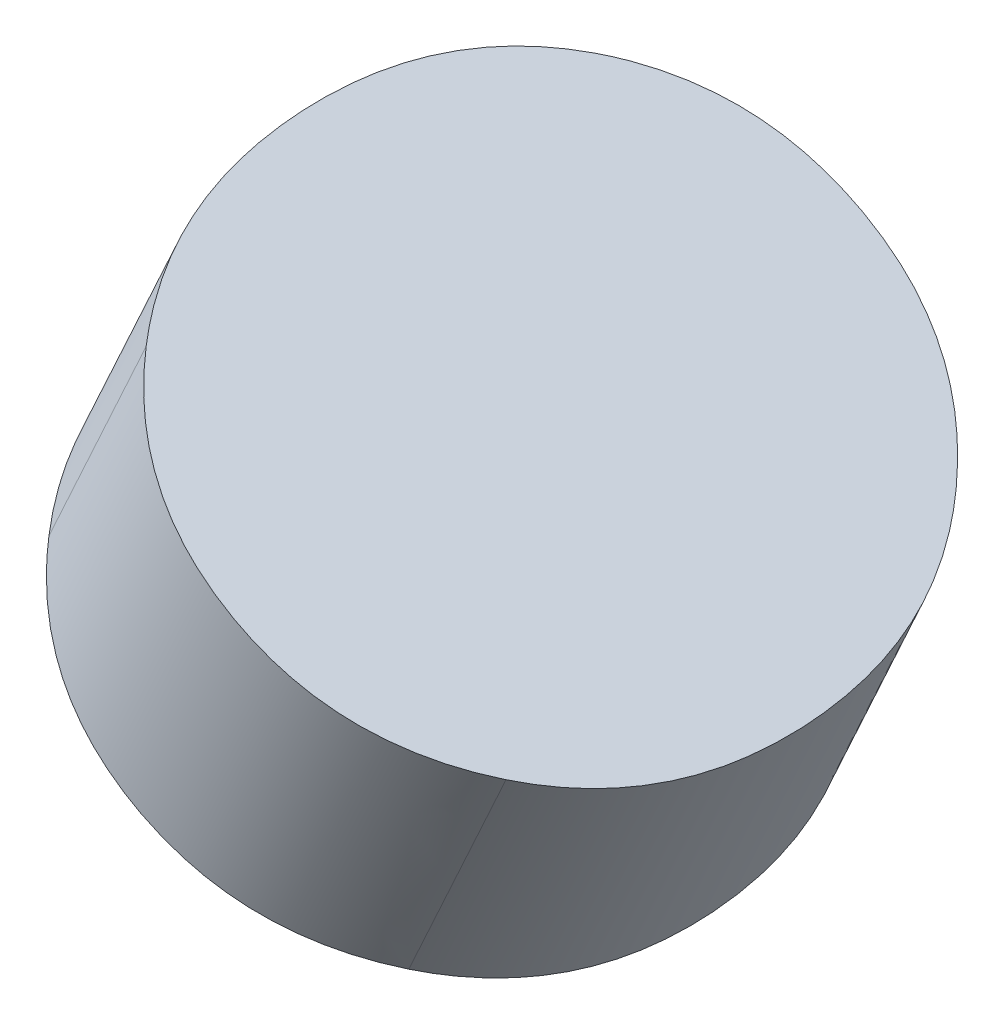
ISO-10303-21;
HEADER;
FILE_DESCRIPTION(('STEP AP214'),'2;1');
FILE_NAME('part.step','',(''),(''),'','','');
FILE_SCHEMA(('AUTOMOTIVE_DESIGN { 1 0 10303 214 1 1 1 1 }'));
ENDSEC;
DATA;
#1=APPLICATION_CONTEXT('core data for automotive mechanical design processes');
#2=APPLICATION_PROTOCOL_DEFINITION('international standard','automotive_design',2000,#1);
#3=PRODUCT_CONTEXT('',#1,'mechanical');
#4=PRODUCT('Part','Part','',(#3));
#5=PRODUCT_RELATED_PRODUCT_CATEGORY('part','',(#4));
#6=PRODUCT_DEFINITION_FORMATION('','',#4);
#7=PRODUCT_DEFINITION_CONTEXT('part definition',#1,'design');
#8=PRODUCT_DEFINITION('design','',#6,#7);
#9=PRODUCT_DEFINITION_SHAPE('','',#8);
#10=(LENGTH_UNIT() NAMED_UNIT(*) SI_UNIT(.MILLI.,.METRE.));
#11=(NAMED_UNIT(*) PLANE_ANGLE_UNIT() SI_UNIT($,.RADIAN.));
#12=(NAMED_UNIT(*) SI_UNIT($,.STERADIAN.) SOLID_ANGLE_UNIT());
#13=UNCERTAINTY_MEASURE_WITH_UNIT(LENGTH_MEASURE(1.E-05),#10,'distance_accuracy_value','');
#14=(GEOMETRIC_REPRESENTATION_CONTEXT(3) GLOBAL_UNCERTAINTY_ASSIGNED_CONTEXT((#13)) GLOBAL_UNIT_ASSIGNED_CONTEXT((#10,
#11,#12)) REPRESENTATION_CONTEXT('',''));
#15=CARTESIAN_POINT('',(0.,0.,0.));
#16=DIRECTION('',(0.,0.,1.));
#17=DIRECTION('',(1.,0.,0.));
#18=AXIS2_PLACEMENT_3D('',#15,#16,#17);
#19=CARTESIAN_POINT('',(5.98629531264846,7.6518678061337,-2.70885291158316));
#20=CARTESIAN_POINT('',(5.98762475457034,7.65139448567997,-2.71031634987988));
#21=CARTESIAN_POINT('',(6.02193615023742,7.63908467378837,-2.74756750561273));
#22=CARTESIAN_POINT('',(6.07789316338917,7.61545117907034,-2.78868061699597));
#23=CARTESIAN_POINT('',(6.15934109940241,7.57511022199703,-2.81572901143361));
#24=CARTESIAN_POINT('',(6.22653275771296,7.53907823213657,-2.8228524474128));
#25=CARTESIAN_POINT('',(6.29300847489024,7.50104766592302,-2.81674962377831));
#26=CARTESIAN_POINT('',(6.37159685840994,7.45271556858546,-2.7909233637115));
#27=CARTESIAN_POINT('',(6.42313357703592,7.41679148584207,-2.75064569518387));
#28=CARTESIAN_POINT('',(6.45343294077434,7.3933062035269,-2.71391271836709));
#29=CARTESIAN_POINT('',(6.45458939810901,7.39240581747993,-2.71248859013043));
#30=(BOUNDED_CURVE() B_SPLINE_CURVE(3,(#19,#20,#21,#22,#23,#24,#25,#26,#27,#28,#29),
.UNSPECIFIED.,.F.,.F.) B_SPLINE_CURVE_WITH_KNOTS((4,1,1,1,1,1,1,1,4),(0.,0.009919115084285,
0.2549865314289,0.3775202396012,0.5000539477735,0.6225945654816,0.7451351831897,0.990216418606,
1.),.UNSPECIFIED.) CURVE() GEOMETRIC_REPRESENTATION_ITEM() RATIONAL_B_SPLINE_CURVE((1.,1.,1.,1.,
1.,1.,1.,1.,1.,1.,1.)) REPRESENTATION_ITEM(''));
#31=DIRECTION('',(-0.479603965309405,-0.863428854211439,-0.15643097575166));
#32=VECTOR('',#31,1.);
#33=SURFACE_OF_LINEAR_EXTRUSION('',#30,#32);
#34=DIRECTION('',(-0.479603965309405,-0.863428854211439,-0.15643097575166));
#35=VECTOR('',#34,1.);
#36=CARTESIAN_POINT('',(5.92795097427504,7.53818549018173,-2.73353620808216));
#37=LINE('',#36,#35);
#38=CARTESIAN_POINT('',(5.92795097427504,7.53818549018173,-2.73353620808216));
#39=VERTEX_POINT('',#38);
#40=CARTESIAN_POINT('',(5.74251238885074,7.2043412417586,-2.79402015100196));
#41=VERTEX_POINT('',#40);
#42=EDGE_CURVE('E11',#39,#41,#37,.T.);
#43=ORIENTED_EDGE('',*,*,#42,.F.);
#44=CARTESIAN_POINT('',(6.38875156484517,7.28286466866965,-2.7370548595334));
#45=CARTESIAN_POINT('',(6.35944906149116,7.30547700433996,-2.77202585073956));
#46=CARTESIAN_POINT('',(6.30924834291947,7.34046981753757,-2.81125939056251));
#47=CARTESIAN_POINT('',(6.23065995939977,7.38880191487513,-2.83708565062932));
#48=CARTESIAN_POINT('',(6.16418424222298,7.42683248108956,-2.84318847426383));
#49=CARTESIAN_POINT('',(6.09699258391243,7.46286447095002,-2.83606503828463));
#50=CARTESIAN_POINT('',(6.01554464789884,7.50320542802257,-2.80901664383698));
#51=CARTESIAN_POINT('',(5.96105787129404,7.52621796701637,-2.76898375450914));
#52=CARTESIAN_POINT('',(5.92795097427504,7.53818549018173,-2.73353620808216));
#53=B_SPLINE_CURVE_WITH_KNOTS('',3,(#44,#45,#46,#47,#48,#49,#50,#51,#52),.UNSPECIFIED.,.F.,.F.,
(4,1,1,1,1,1,4),(0.,0.2500070484085,0.3750105726127,0.500014096817,0.6250105726127,
0.7500070484085,1.),.UNSPECIFIED.);
#54=CARTESIAN_POINT('',(6.38875156484517,7.28286466866965,-2.7370548595334));
#55=VERTEX_POINT('',#54);
#56=EDGE_CURVE('E47',#55,#39,#53,.T.);
#57=ORIENTED_EDGE('',*,*,#56,.F.);
#58=DIRECTION('',(-0.479603965309405,-0.863428854211439,-0.15643097575166));
#59=VECTOR('',#58,1.);
#60=CARTESIAN_POINT('',(6.38875156484517,7.28286466866965,-2.7370548595334));
#61=LINE('',#60,#59);
#62=CARTESIAN_POINT('',(6.20331297942086,6.94902042024652,-2.7975388024532));
#63=VERTEX_POINT('',#62);
#64=EDGE_CURVE('E86',#55,#63,#61,.T.);
#65=ORIENTED_EDGE('',*,*,#64,.T.);
#66=CARTESIAN_POINT('',(5.74251238885074,7.2043412417586,-2.79402015100196));
#67=CARTESIAN_POINT('',(5.77561928586939,7.19237371859248,-2.82946769741893));
#68=CARTESIAN_POINT('',(5.83010606247405,7.16936117959856,-2.86950058675677));
#69=CARTESIAN_POINT('',(5.91155399848778,7.12902022252613,-2.89654898119442));
#70=CARTESIAN_POINT('',(5.97874565679819,7.09298823266555,-2.90367241718362));
#71=CARTESIAN_POINT('',(6.04522137397561,7.05495766645212,-2.89756959353912));
#72=CARTESIAN_POINT('',(6.1238097574953,7.00662556911456,-2.87174333347231));
#73=CARTESIAN_POINT('',(6.17401047606651,6.97163275591608,-2.83250979364935));
#74=CARTESIAN_POINT('',(6.20331297942086,6.94902042024652,-2.7975388024532));
#75=B_SPLINE_CURVE_WITH_KNOTS('',3,(#66,#67,#68,#69,#70,#71,#72,#73,#74),.UNSPECIFIED.,.F.,.F.,
(4,1,1,1,1,1,4),(0.,0.2499929515915,0.3749894273873,0.499985903183,0.6249894273873,
0.7499929515915,1.),.UNSPECIFIED.);
#76=EDGE_CURVE('E81',#41,#63,#75,.T.);
#77=ORIENTED_EDGE('',*,*,#76,.F.);
#78=EDGE_LOOP('',(#43,#57,#65,#77));
#79=FACE_BOUND('',#78,.T.);
#80=ADVANCED_FACE('F17',(#79),#33,.T.);
#81=CARTESIAN_POINT('',(5.95552121621187,7.5714000306122,-2.17035612413858));
#82=CARTESIAN_POINT('',(5.95436901926692,7.57229670979813,-2.17177285415556));
#83=CARTESIAN_POINT('',(5.92486076714491,7.59537143757636,-2.20866523439478));
#84=CARTESIAN_POINT('',(5.89395022798105,7.62381940171874,-2.27091617851873));
#85=CARTESIAN_POINT('',(5.87767646136616,7.64988819658238,-2.36491026511709));
#86=CARTESIAN_POINT('',(5.87756406124387,7.66431503831933,-2.44419535444724));
#87=CARTESIAN_POINT('',(5.88892142609277,7.67236671897118,-2.52345772916173));
#88=CARTESIAN_POINT('',(5.91851918123459,7.67293622006967,-2.61734530059675));
#89=CARTESIAN_POINT('',(5.95825880666693,7.66210434491754,-2.679396491797));
#90=CARTESIAN_POINT('',(5.99300723727406,7.64944883693318,-2.71607947176047));
#91=CARTESIAN_POINT('',(5.99437927094351,7.6489453654188,-2.71750707236914));
#92=(BOUNDED_CURVE() B_SPLINE_CURVE(3,(#81,#82,#83,#84,#85,#86,#87,#88,#89,#90,#91),
.UNSPECIFIED.,.F.,.F.) B_SPLINE_CURVE_WITH_KNOTS((4,1,1,1,1,1,1,1,4),(0.,0.009838611854684,
0.2548174635686,0.3773068894255,0.4997963152825,0.6223513768837,0.7449064384849,0.9900165616873,
1.),.UNSPECIFIED.) CURVE() GEOMETRIC_REPRESENTATION_ITEM() RATIONAL_B_SPLINE_CURVE((1.,1.,1.,1.,
1.,1.,1.,1.,1.,1.,1.)) REPRESENTATION_ITEM(''));
#93=DIRECTION('',(-0.479603965309405,-0.863428854211439,-0.15643097575166));
#94=VECTOR('',#93,1.);
#95=SURFACE_OF_LINEAR_EXTRUSION('',#92,#94);
#96=DIRECTION('',(-0.479603965309405,-0.863428854211439,-0.15643097575166));
#97=VECTOR('',#96,1.);
#98=CARTESIAN_POINT('',(5.88975472027792,7.46182705151872,-2.19496541877811));
#99=LINE('',#98,#97);
#100=CARTESIAN_POINT('',(5.88975472027792,7.46182705151872,-2.19496541877811));
#101=VERTEX_POINT('',#100);
#102=CARTESIAN_POINT('',(5.70431613485313,7.12798280309471,-2.2554493616979));
#103=VERTEX_POINT('',#102);
#104=EDGE_CURVE('E94',#101,#103,#99,.T.);
#105=ORIENTED_EDGE('',*,*,#104,.F.);
#106=CARTESIAN_POINT('',(5.92795097427504,7.53818549018173,-2.73353620808216));
#107=CARTESIAN_POINT('',(5.89485974292957,7.55014494300702,-2.69809214661943));
#108=CARTESIAN_POINT('',(5.85617066574461,7.56069046902266,-2.63768132744778));
#109=CARTESIAN_POINT('',(5.8265729106023,7.56012096792329,-2.54379375601275));
#110=CARTESIAN_POINT('',(5.8152155457534,7.55206928727144,-2.46453138129825));
#111=CARTESIAN_POINT('',(5.81532794587569,7.53764244553449,-2.3852462919681));
#112=CARTESIAN_POINT('',(5.83160171249058,7.51157365067085,-2.29125220536974));
#113=CARTESIAN_POINT('',(5.86170623192498,7.48386749243044,-2.23062450984276));
#114=CARTESIAN_POINT('',(5.88975472027792,7.46182705151872,-2.19496541877811));
#115=B_SPLINE_CURVE_WITH_KNOTS('',3,(#106,#107,#108,#109,#110,#111,#112,#113,#114),
.UNSPECIFIED.,.F.,.F.,(4,1,1,1,1,1,4),(0.,0.25006696309,0.375100444635,0.50013392618,
0.625100444635,0.75006696309,1.),.UNSPECIFIED.);
#116=EDGE_CURVE('E29',#39,#101,#115,.T.);
#117=ORIENTED_EDGE('',*,*,#116,.F.);
#118=ORIENTED_EDGE('',*,*,#42,.T.);
#119=CARTESIAN_POINT('',(5.70431613485313,7.12798280309471,-2.2554493616979));
#120=CARTESIAN_POINT('',(5.67626764650082,7.15002324400743,-2.29110845275256));
#121=CARTESIAN_POINT('',(5.64616312706579,7.17772940224684,-2.35173614828952));
#122=CARTESIAN_POINT('',(5.62988936045152,7.20379819711148,-2.4457302348779));
#123=CARTESIAN_POINT('',(5.62977696032923,7.21822503884843,-2.52501532420805));
#124=CARTESIAN_POINT('',(5.64113432517814,7.22627671950028,-2.60427769892255));
#125=CARTESIAN_POINT('',(5.67073208031982,7.22684622059865,-2.69816527036756));
#126=CARTESIAN_POINT('',(5.7094211575054,7.216300694584,-2.75857608952923));
#127=CARTESIAN_POINT('',(5.74251238885074,7.2043412417586,-2.79402015100196));
#128=B_SPLINE_CURVE_WITH_KNOTS('',3,(#119,#120,#121,#122,#123,#124,#125,#126,#127),
.UNSPECIFIED.,.F.,.F.,(4,1,1,1,1,1,4),(0.,0.24993303691,0.374899555365,0.49986607382,
0.624899555365,0.74993303691,1.),.UNSPECIFIED.);
#129=EDGE_CURVE('E96',#103,#41,#128,.T.);
#130=ORIENTED_EDGE('',*,*,#129,.F.);
#131=EDGE_LOOP('',(#105,#117,#118,#130));
#132=FACE_BOUND('',#131,.T.);
#133=ADVANCED_FACE('F159',(#132),#95,.T.);
#134=CARTESIAN_POINT('',(6.11072957166849,7.31988000552062,-2.08897131981858));
#135=DIRECTION('',(0.479603965309405,0.863428854211439,0.15643097575166));
#136=DIRECTION('',(0.310089363611885,0.,-0.950707413758185));
#137=AXIS2_PLACEMENT_3D('',#134,#135,#136);
#138=PLANE('',#137);
#139=CARTESIAN_POINT('',(6.34877093628127,7.20749491793282,-2.19847044482981));
#140=CARTESIAN_POINT('',(6.38370778476195,7.19463638459697,-2.23461048893876));
#141=CARTESIAN_POINT('',(6.42447100425988,7.18307607987447,-2.29577932715858));
#142=CARTESIAN_POINT('',(6.45546175094043,7.18295650907645,-2.39013432333844));
#143=CARTESIAN_POINT('',(6.46714107976885,7.19084977862544,-2.46950945375151));
#144=CARTESIAN_POINT('',(6.46677092092275,7.20539945655721,-2.54868227765138));
#145=CARTESIAN_POINT('',(6.4495704287285,7.23189897424035,-2.64221249988965));
#146=CARTESIAN_POINT('',(6.41805430700368,7.26025281039325,-2.70208723549265));
#147=CARTESIAN_POINT('',(6.38875156484517,7.28286466866965,-2.7370548595334));
#148=B_SPLINE_CURVE_WITH_KNOTS('',3,(#139,#140,#141,#142,#143,#144,#145,#146,#147),
.UNSPECIFIED.,.F.,.F.,(4,1,1,1,1,1,4),(0.,0.24993303691,0.374899555365,0.49986607382,
0.624899555365,0.74993303691,1.),.UNSPECIFIED.);
#149=CARTESIAN_POINT('',(6.34877093628127,7.20749491793282,-2.19847044482981));
#150=VERTEX_POINT('',#149);
#151=EDGE_CURVE('E98',#150,#55,#148,.T.);
#152=ORIENTED_EDGE('',*,*,#151,.T.);
#153=ORIENTED_EDGE('',*,*,#56,.T.);
#154=ORIENTED_EDGE('',*,*,#116,.T.);
#155=CARTESIAN_POINT('',(5.88975472027792,7.46182705151872,-2.19496541877811));
#156=CARTESIAN_POINT('',(5.91781635369587,7.43977350129836,-2.15927427187358));
#157=CARTESIAN_POINT('',(5.96661821036554,7.40541567438791,-2.11925678097025));
#158=CARTESIAN_POINT('',(6.04430343935176,7.35750070939456,-2.0929639100318));
#159=CARTESIAN_POINT('',(6.10989888454189,7.31993392860747,-2.08672213554805));
#160=CARTESIAN_POINT('',(6.17635789197974,7.28432613693814,-2.09394071057421));
#161=CARTESIAN_POINT('',(6.25772078141178,7.24412472081588,-2.1214985629804));
#162=CARTESIAN_POINT('',(6.31382152141695,7.22035458818351,-2.16229814854955));
#163=CARTESIAN_POINT('',(6.34877093628127,7.20749491793282,-2.19847044482981));
#164=B_SPLINE_CURVE_WITH_KNOTS('',3,(#155,#156,#157,#158,#159,#160,#161,#162,#163),
.UNSPECIFIED.,.F.,.F.,(4,1,1,1,1,1,4),(0.,0.2533428571429,0.3800142857143,0.5066857142857,
0.6300142857143,0.7533428571429,1.),.UNSPECIFIED.);
#165=EDGE_CURVE('E21',#101,#150,#164,.T.);
#166=ORIENTED_EDGE('',*,*,#165,.T.);
#167=EDGE_LOOP('',(#152,#153,#154,#166));
#168=FACE_BOUND('',#167,.T.);
#169=ADVANCED_FACE('F165',(#168),#138,.T.);
#170=CARTESIAN_POINT('',(6.44756880378263,7.39782264161647,-2.72086249034456));
#171=CARTESIAN_POINT('',(6.44875898113704,7.396912717011,-2.71948909622314));
#172=CARTESIAN_POINT('',(6.47956820211204,7.37324943712933,-2.68333683123879));
#173=CARTESIAN_POINT('',(6.51191894421849,7.34414472528736,-2.62187647303862));
#174=CARTESIAN_POINT('',(6.52911943641322,7.3176452076051,-2.52834625080036));
#175=CARTESIAN_POINT('',(6.52948959525932,7.30309552967332,-2.4491734269005));
#176=CARTESIAN_POINT('',(6.5178102664309,7.29520226012434,-2.36979829648743));
#177=CARTESIAN_POINT('',(6.48681951975035,7.29532183092236,-2.27544330030757));
#178=CARTESIAN_POINT('',(6.44499177567488,7.30718403104569,-2.21267704823027));
#179=CARTESIAN_POINT('',(6.40837043257036,7.3207559692908,-2.1753101632455));
#180=CARTESIAN_POINT('',(6.40697806017258,7.32127548023884,-2.17390873631907));
#181=(BOUNDED_CURVE() B_SPLINE_CURVE(3,(#170,#171,#172,#173,#174,#175,#176,#177,#178,#179,#180),
.UNSPECIFIED.,.F.,.F.) B_SPLINE_CURVE_WITH_KNOTS((4,1,1,1,1,1,1,1,4),(0.,0.009741395301832,
0.2549714475244,0.3775864736357,0.500201499747,0.6227508579994,0.7453002162518,0.9903989327566,
1.),.UNSPECIFIED.) CURVE() GEOMETRIC_REPRESENTATION_ITEM() RATIONAL_B_SPLINE_CURVE((1.,1.,1.,1.,
1.,1.,1.,1.,1.,1.,1.)) REPRESENTATION_ITEM(''));
#182=DIRECTION('',(-0.479603965309405,-0.863428854211439,-0.15643097575166));
#183=VECTOR('',#182,1.);
#184=SURFACE_OF_LINEAR_EXTRUSION('',#181,#183);
#185=ORIENTED_EDGE('',*,*,#64,.F.);
#186=ORIENTED_EDGE('',*,*,#151,.F.);
#187=DIRECTION('',(0.479603965309405,0.863428854211439,0.15643097575166));
#188=VECTOR('',#187,1.);
#189=CARTESIAN_POINT('',(6.16333235085648,6.87365066950881,-2.25895438774959));
#190=LINE('',#189,#188);
#191=CARTESIAN_POINT('',(6.16333235085648,6.87365066950881,-2.25895438774959));
#192=VERTEX_POINT('',#191);
#193=EDGE_CURVE('E92',#192,#150,#190,.T.);
#194=ORIENTED_EDGE('',*,*,#193,.F.);
#195=CARTESIAN_POINT('',(6.20331297942086,6.94902042024652,-2.7975388024532));
#196=CARTESIAN_POINT('',(6.23261572157951,6.92640856197024,-2.76257117840245));
#197=CARTESIAN_POINT('',(6.26413184330371,6.89805472581634,-2.70269644280943));
#198=CARTESIAN_POINT('',(6.28133233549859,6.8715552081342,-2.60916622056118));
#199=CARTESIAN_POINT('',(6.28170249434469,6.85700553020243,-2.52999339666131));
#200=CARTESIAN_POINT('',(6.27002316551627,6.84911226065344,-2.45061826624825));
#201=CARTESIAN_POINT('',(6.23903241883508,6.84923183145046,-2.35626327007836));
#202=CARTESIAN_POINT('',(6.19826919933778,6.86079213617396,-2.29509443184856));
#203=CARTESIAN_POINT('',(6.16333235085648,6.87365066950881,-2.25895438774959));
#204=B_SPLINE_CURVE_WITH_KNOTS('',3,(#195,#196,#197,#198,#199,#200,#201,#202,#203),
.UNSPECIFIED.,.F.,.F.,(4,1,1,1,1,1,4),(0.,0.25006696309,0.375100444635,0.50013392618,
0.625100444635,0.75006696309,1.),.UNSPECIFIED.);
#205=EDGE_CURVE('E75',#63,#192,#204,.T.);
#206=ORIENTED_EDGE('',*,*,#205,.F.);
#207=EDGE_LOOP('',(#185,#186,#194,#206));
#208=FACE_BOUND('',#207,.T.);
#209=ADVANCED_FACE('F97',(#208),#184,.T.);
#210=CARTESIAN_POINT('',(5.9252909862437,6.98603575709662,-2.14945526273837));
#211=DIRECTION('',(0.479603965309405,0.863428854211439,0.15643097575166));
#212=DIRECTION('',(0.310089363611885,0.,-0.950707413758185));
#213=AXIS2_PLACEMENT_3D('',#210,#211,#212);
#214=PLANE('',#213);
#215=ORIENTED_EDGE('',*,*,#129,.T.);
#216=ORIENTED_EDGE('',*,*,#76,.T.);
#217=ORIENTED_EDGE('',*,*,#205,.T.);
#218=CARTESIAN_POINT('',(6.16333235085648,6.87365066950881,-2.25895438774959));
#219=CARTESIAN_POINT('',(6.12838293599278,6.8865103397605,-2.22278209145936));
#220=CARTESIAN_POINT('',(6.07228219598748,6.91028047239275,-2.1819825059002));
#221=CARTESIAN_POINT('',(5.99091930655495,6.95048188851413,-2.15442465349399));
#222=CARTESIAN_POINT('',(5.9244602991171,6.98608968018346,-2.14720607846784));
#223=CARTESIAN_POINT('',(5.8588648539276,7.02365646097155,-2.15344785294161));
#224=CARTESIAN_POINT('',(5.78117962494138,7.0715714259649,-2.17974072388005));
#225=CARTESIAN_POINT('',(5.7323777682717,7.10592925287534,-2.21975821478338));
#226=CARTESIAN_POINT('',(5.70431613485313,7.12798280309471,-2.2554493616979));
#227=B_SPLINE_CURVE_WITH_KNOTS('',3,(#218,#219,#220,#221,#222,#223,#224,#225,#226),
.UNSPECIFIED.,.F.,.F.,(4,1,1,1,1,1,4),(0.,0.2466571428571,0.3699857142857,0.4933142857143,
0.6199857142857,0.7466571428571,1.),.UNSPECIFIED.);
#228=EDGE_CURVE('E79',#192,#103,#227,.T.);
#229=ORIENTED_EDGE('',*,*,#228,.T.);
#230=EDGE_LOOP('',(#215,#216,#217,#229));
#231=FACE_BOUND('',#230,.T.);
#232=ADVANCED_FACE('F78',(#231),#214,.F.);
#233=CARTESIAN_POINT('',(6.41519099543763,7.31825202899954,-2.1824007966282));
#234=CARTESIAN_POINT('',(6.4138375410771,7.31874370717204,-2.18096506464521));
#235=CARTESIAN_POINT('',(6.37762638287935,7.33198327897659,-2.14302125767977));
#236=CARTESIAN_POINT('',(6.32006929690225,7.35637047186377,-2.10116253612939));
#237=CARTESIAN_POINT('',(6.23870640746959,7.39657188798503,-2.07360468373318));
#238=CARTESIAN_POINT('',(6.17224740003236,7.43217967965535,-2.06638610869704));
#239=CARTESIAN_POINT('',(6.10665195484223,7.46974646044245,-2.07262788318079));
#240=CARTESIAN_POINT('',(6.02896672585601,7.5176614254358,-2.09892075411924));
#241=CARTESIAN_POINT('',(5.97885436856261,7.55294188022659,-2.14001285468275));
#242=CARTESIAN_POINT('',(5.94984983394327,7.57584806572174,-2.1775193117825));
#243=CARTESIAN_POINT('',(5.94873403652081,7.5767336147414,-2.17898620608574));
#244=(BOUNDED_CURVE() B_SPLINE_CURVE(3,(#233,#234,#235,#236,#237,#238,#239,#240,#241,#242,#243),
.UNSPECIFIED.,.F.,.F.) B_SPLINE_CURVE_WITH_KNOTS((4,1,1,1,1,1,1,1,4),(0.,0.009418070462322,
0.2512840064223,0.3722169744023,0.4931499423823,0.6173608339702,0.7415717255581,0.9899935087339,
1.),.UNSPECIFIED.) CURVE() GEOMETRIC_REPRESENTATION_ITEM() RATIONAL_B_SPLINE_CURVE((1.,1.,1.,1.,
1.,1.,1.,1.,1.,1.,1.)) REPRESENTATION_ITEM(''));
#245=DIRECTION('',(-0.479603965309405,-0.863428854211439,-0.15643097575166));
#246=VECTOR('',#245,1.);
#247=SURFACE_OF_LINEAR_EXTRUSION('',#244,#246);
#248=ORIENTED_EDGE('',*,*,#193,.T.);
#249=ORIENTED_EDGE('',*,*,#165,.F.);
#250=ORIENTED_EDGE('',*,*,#104,.T.);
#251=ORIENTED_EDGE('',*,*,#228,.F.);
#252=EDGE_LOOP('',(#248,#249,#250,#251));
#253=FACE_BOUND('',#252,.T.);
#254=ADVANCED_FACE('F90',(#253),#247,.T.);
#255=CLOSED_SHELL('',(#80,#133,#169,#209,#232,#254));
#256=MANIFOLD_SOLID_BREP('B1',#255);
#257=ADVANCED_BREP_SHAPE_REPRESENTATION('',(#18,#256),#14);
#258=SHAPE_DEFINITION_REPRESENTATION(#9,#257);
ENDSEC;
END-ISO-10303-21;
